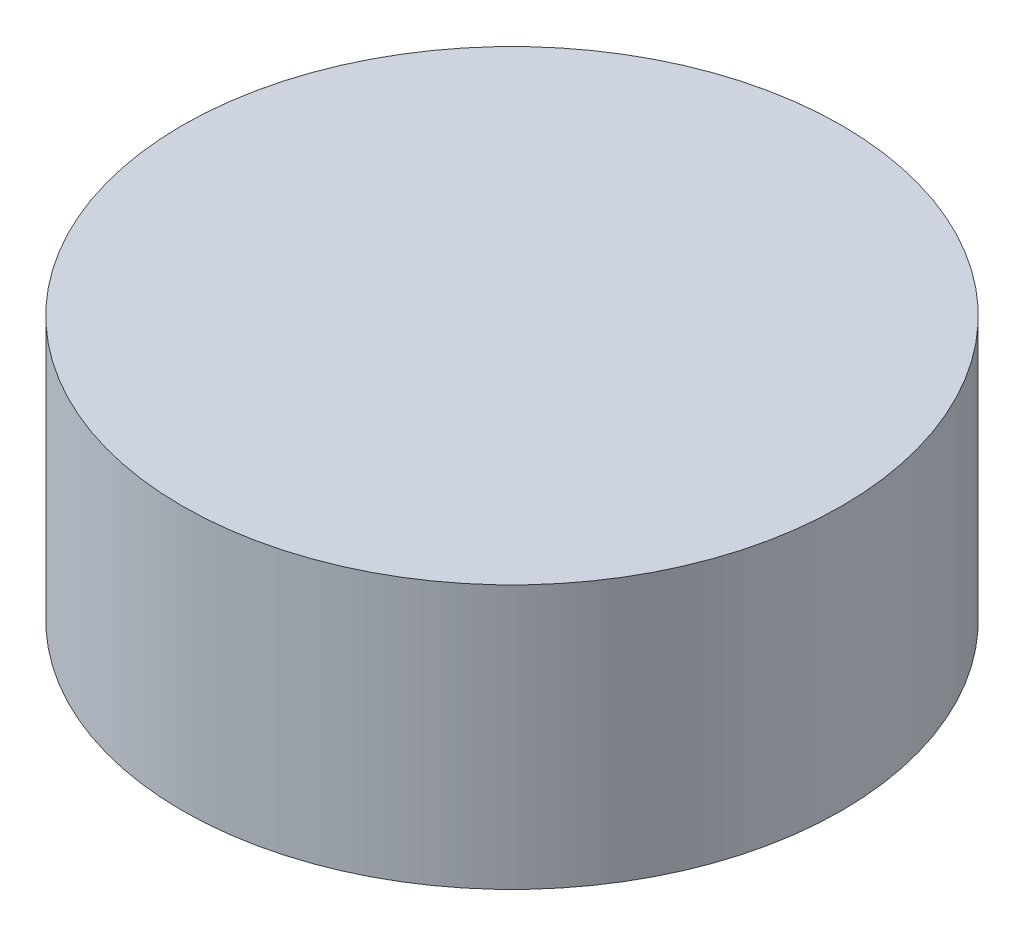
ISO-10303-21;
HEADER;
FILE_DESCRIPTION(('STEP AP214'),'2;1');
FILE_NAME('part.step','',(''),(''),'','','');
FILE_SCHEMA(('AUTOMOTIVE_DESIGN { 1 0 10303 214 1 1 1 1 }'));
ENDSEC;
DATA;
#1=APPLICATION_CONTEXT('core data for automotive mechanical design processes');
#2=APPLICATION_PROTOCOL_DEFINITION('international standard','automotive_design',2000,#1);
#3=PRODUCT_CONTEXT('',#1,'mechanical');
#4=PRODUCT('Part','Part','',(#3));
#5=PRODUCT_RELATED_PRODUCT_CATEGORY('part','',(#4));
#6=PRODUCT_DEFINITION_FORMATION('','',#4);
#7=PRODUCT_DEFINITION_CONTEXT('part definition',#1,'design');
#8=PRODUCT_DEFINITION('design','',#6,#7);
#9=PRODUCT_DEFINITION_SHAPE('','',#8);
#10=(LENGTH_UNIT() NAMED_UNIT(*) SI_UNIT(.MILLI.,.METRE.));
#11=(NAMED_UNIT(*) PLANE_ANGLE_UNIT() SI_UNIT($,.RADIAN.));
#12=(NAMED_UNIT(*) SI_UNIT($,.STERADIAN.) SOLID_ANGLE_UNIT());
#13=UNCERTAINTY_MEASURE_WITH_UNIT(LENGTH_MEASURE(1.E-05),#10,'distance_accuracy_value','');
#14=(GEOMETRIC_REPRESENTATION_CONTEXT(3) GLOBAL_UNCERTAINTY_ASSIGNED_CONTEXT((#13)) GLOBAL_UNIT_ASSIGNED_CONTEXT((#10,
#11,#12)) REPRESENTATION_CONTEXT('',''));
#15=CARTESIAN_POINT('',(0.,0.,0.));
#16=DIRECTION('',(0.,0.,1.));
#17=DIRECTION('',(1.,0.,0.));
#18=AXIS2_PLACEMENT_3D('',#15,#16,#17);
#19=CARTESIAN_POINT('',(0.,4.,0.));
#20=DIRECTION('',(0.,-1.,0.));
#21=DIRECTION('',(0.,0.,-1.));
#22=AXIS2_PLACEMENT_3D('',#19,#20,#21);
#23=CYLINDRICAL_SURFACE('',#22,5.);
#24=CARTESIAN_POINT('',(0.,4.,0.));
#25=DIRECTION('',(0.,1.,0.));
#26=DIRECTION('',(0.,0.,1.));
#27=AXIS2_PLACEMENT_3D('',#24,#25,#26);
#28=CIRCLE('',#27,5.);
#29=CARTESIAN_POINT('',(0.,4.,5.));
#30=VERTEX_POINT('',#29);
#31=EDGE_CURVE('E10',#30,#30,#28,.T.);
#32=ORIENTED_EDGE('',*,*,#31,.F.);
#33=EDGE_LOOP('',(#32));
#34=FACE_BOUND('',#33,.T.);
#35=CARTESIAN_POINT('',(0.,0.,0.));
#36=DIRECTION('',(0.,1.,0.));
#37=DIRECTION('',(0.,0.,1.));
#38=AXIS2_PLACEMENT_3D('',#35,#36,#37);
#39=CIRCLE('',#38,5.);
#40=CARTESIAN_POINT('',(0.,0.,5.));
#41=VERTEX_POINT('',#40);
#42=EDGE_CURVE('E40',#41,#41,#39,.T.);
#43=ORIENTED_EDGE('',*,*,#42,.T.);
#44=EDGE_LOOP('',(#43));
#45=FACE_BOUND('',#44,.T.);
#46=ADVANCED_FACE('F37',(#34,#45),#23,.T.);
#47=CARTESIAN_POINT('',(0.,4.,0.));
#48=DIRECTION('',(0.,1.,0.));
#49=DIRECTION('',(0.,0.,1.));
#50=AXIS2_PLACEMENT_3D('',#47,#48,#49);
#51=PLANE('',#50);
#52=ORIENTED_EDGE('',*,*,#31,.T.);
#53=EDGE_LOOP('',(#52));
#54=FACE_BOUND('',#53,.T.);
#55=ADVANCED_FACE('F54',(#54),#51,.T.);
#56=CARTESIAN_POINT('',(0.,0.,0.));
#57=DIRECTION('',(0.,1.,0.));
#58=DIRECTION('',(0.,0.,1.));
#59=AXIS2_PLACEMENT_3D('',#56,#57,#58);
#60=PLANE('',#59);
#61=ORIENTED_EDGE('',*,*,#42,.F.);
#62=EDGE_LOOP('',(#61));
#63=FACE_BOUND('',#62,.T.);
#64=ADVANCED_FACE('F52',(#63),#60,.F.);
#65=CLOSED_SHELL('',(#46,#55,#64));
#66=MANIFOLD_SOLID_BREP('B2',#65);
#67=ADVANCED_BREP_SHAPE_REPRESENTATION('',(#18,#66),#14);
#68=SHAPE_DEFINITION_REPRESENTATION(#9,#67);
ENDSEC;
END-ISO-10303-21;
